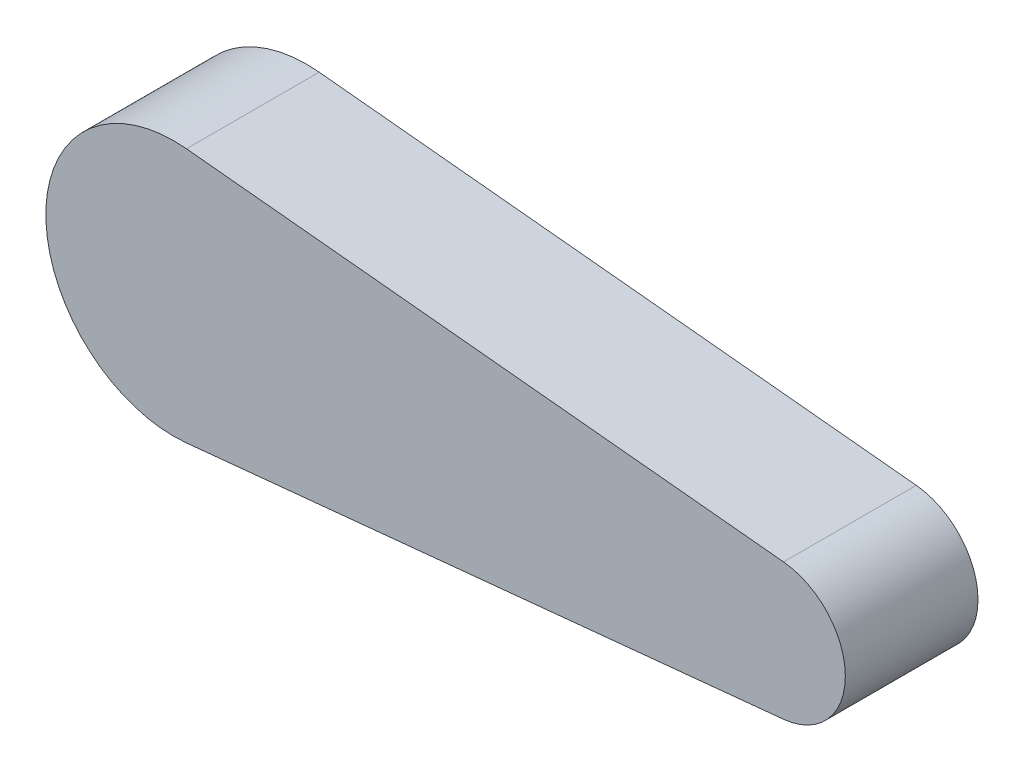
ISO-10303-21;
HEADER;
FILE_DESCRIPTION(('STEP AP214'),'2;1');
FILE_NAME('part.step','',(''),(''),'','','');
FILE_SCHEMA(('AUTOMOTIVE_DESIGN { 1 0 10303 214 1 1 1 1 }'));
ENDSEC;
DATA;
#1=APPLICATION_CONTEXT('core data for automotive mechanical design processes');
#2=APPLICATION_PROTOCOL_DEFINITION('international standard','automotive_design',2000,#1);
#3=PRODUCT_CONTEXT('',#1,'mechanical');
#4=PRODUCT('Part','Part','',(#3));
#5=PRODUCT_RELATED_PRODUCT_CATEGORY('part','',(#4));
#6=PRODUCT_DEFINITION_FORMATION('','',#4);
#7=PRODUCT_DEFINITION_CONTEXT('part definition',#1,'design');
#8=PRODUCT_DEFINITION('design','',#6,#7);
#9=PRODUCT_DEFINITION_SHAPE('','',#8);
#10=(LENGTH_UNIT() NAMED_UNIT(*) SI_UNIT(.MILLI.,.METRE.));
#11=(NAMED_UNIT(*) PLANE_ANGLE_UNIT() SI_UNIT($,.RADIAN.));
#12=(NAMED_UNIT(*) SI_UNIT($,.STERADIAN.) SOLID_ANGLE_UNIT());
#13=UNCERTAINTY_MEASURE_WITH_UNIT(LENGTH_MEASURE(1.E-05),#10,'distance_accuracy_value','');
#14=(GEOMETRIC_REPRESENTATION_CONTEXT(3) GLOBAL_UNCERTAINTY_ASSIGNED_CONTEXT((#13)) GLOBAL_UNIT_ASSIGNED_CONTEXT((#10,
#11,#12)) REPRESENTATION_CONTEXT('',''));
#15=CARTESIAN_POINT('',(0.,0.,0.));
#16=DIRECTION('',(0.,0.,1.));
#17=DIRECTION('',(1.,0.,0.));
#18=AXIS2_PLACEMENT_3D('',#15,#16,#17);
#19=CARTESIAN_POINT('',(9.64712570172139,0.,10.));
#20=DIRECTION('',(0.,0.,-1.));
#21=DIRECTION('',(-1.,0.,0.));
#22=AXIS2_PLACEMENT_3D('',#19,#20,#21);
#23=CYLINDRICAL_SURFACE('',#22,9.64712570172139);
#24=CARTESIAN_POINT('',(9.64712570172139,0.,0.));
#25=DIRECTION('',(0.,0.,1.));
#26=DIRECTION('',(1.,0.,0.));
#27=AXIS2_PLACEMENT_3D('',#24,#25,#26);
#28=CIRCLE('',#27,9.64712570172139);
#29=CARTESIAN_POINT('',(10.5995091879355,9.6,0.));
#30=VERTEX_POINT('',#29);
#31=CARTESIAN_POINT('',(10.5995091879355,-9.6,0.));
#32=VERTEX_POINT('',#31);
#33=EDGE_CURVE('E107',#30,#32,#28,.T.);
#34=ORIENTED_EDGE('',*,*,#33,.T.);
#35=DIRECTION('',(0.,0.,-1.));
#36=VECTOR('',#35,1.);
#37=CARTESIAN_POINT('',(10.5995091879355,-9.6,10.));
#38=LINE('',#37,#36);
#39=CARTESIAN_POINT('',(10.5995091879355,-9.6,10.));
#40=VERTEX_POINT('',#39);
#41=EDGE_CURVE('E11',#40,#32,#38,.T.);
#42=ORIENTED_EDGE('',*,*,#41,.F.);
#43=CARTESIAN_POINT('',(9.64712570172139,0.,10.));
#44=DIRECTION('',(0.,0.,1.));
#45=DIRECTION('',(1.,0.,0.));
#46=AXIS2_PLACEMENT_3D('',#43,#44,#45);
#47=CIRCLE('',#46,9.64712570172139);
#48=CARTESIAN_POINT('',(10.5995091879355,9.6,10.));
#49=VERTEX_POINT('',#48);
#50=EDGE_CURVE('E91',#49,#40,#47,.T.);
#51=ORIENTED_EDGE('',*,*,#50,.F.);
#52=DIRECTION('',(0.,0.,-1.));
#53=VECTOR('',#52,1.);
#54=CARTESIAN_POINT('',(10.5995091879355,9.6,10.));
#55=LINE('',#54,#53);
#56=EDGE_CURVE('E103',#49,#30,#55,.T.);
#57=ORIENTED_EDGE('',*,*,#56,.T.);
#58=EDGE_LOOP('',(#34,#42,#51,#57));
#59=FACE_BOUND('',#58,.T.);
#60=ADVANCED_FACE('F39',(#59),#23,.T.);
#61=CARTESIAN_POINT('',(10.5995091879355,-9.6,10.));
#62=DIRECTION('',(-0.0987219940592439,0.995115052588879,0.));
#63=DIRECTION('',(-0.995115052588879,-0.0987219940592439,0.));
#64=AXIS2_PLACEMENT_3D('',#61,#62,#63);
#65=PLANE('',#64);
#66=DIRECTION('',(0.995115052588878,0.0987219940592439,0.));
#67=VECTOR('',#66,1.);
#68=CARTESIAN_POINT('',(10.5995091879355,-9.6,0.));
#69=LINE('',#68,#67);
#70=CARTESIAN_POINT('',(55.5995091879355,-5.13570240837132,0.));
#71=VERTEX_POINT('',#70);
#72=EDGE_CURVE('E96',#32,#71,#69,.T.);
#73=ORIENTED_EDGE('',*,*,#72,.T.);
#74=DIRECTION('',(0.,0.,-1.));
#75=VECTOR('',#74,1.);
#76=CARTESIAN_POINT('',(55.5995091879355,-5.13570240837132,10.));
#77=LINE('',#76,#75);
#78=CARTESIAN_POINT('',(55.5995091879355,-5.13570240837132,10.));
#79=VERTEX_POINT('',#78);
#80=EDGE_CURVE('E48',#79,#71,#77,.T.);
#81=ORIENTED_EDGE('',*,*,#80,.F.);
#82=DIRECTION('',(0.995115052588878,0.0987219940592439,0.));
#83=VECTOR('',#82,1.);
#84=CARTESIAN_POINT('',(10.5995091879355,-9.6,10.));
#85=LINE('',#84,#83);
#86=EDGE_CURVE('E86',#40,#79,#85,.T.);
#87=ORIENTED_EDGE('',*,*,#86,.F.);
#88=ORIENTED_EDGE('',*,*,#41,.T.);
#89=EDGE_LOOP('',(#73,#81,#87,#88));
#90=FACE_BOUND('',#89,.T.);
#91=ADVANCED_FACE('F95',(#90),#65,.F.);
#92=CARTESIAN_POINT('',(55.0900135458685,0.,10.));
#93=DIRECTION('',(0.,0.,-1.));
#94=DIRECTION('',(-1.,0.,0.));
#95=AXIS2_PLACEMENT_3D('',#92,#93,#94);
#96=CYLINDRICAL_SURFACE('',#95,5.1609131979366);
#97=CARTESIAN_POINT('',(55.0900135458685,0.,0.));
#98=DIRECTION('',(0.,0.,1.));
#99=DIRECTION('',(-1.,0.,0.));
#100=AXIS2_PLACEMENT_3D('',#97,#98,#99);
#101=CIRCLE('',#100,5.1609131979366);
#102=CARTESIAN_POINT('',(55.5995091879355,5.13570240837132,0.));
#103=VERTEX_POINT('',#102);
#104=EDGE_CURVE('E73',#71,#103,#101,.T.);
#105=ORIENTED_EDGE('',*,*,#104,.T.);
#106=DIRECTION('',(0.,0.,-1.));
#107=VECTOR('',#106,1.);
#108=CARTESIAN_POINT('',(55.5995091879355,5.13570240837132,10.));
#109=LINE('',#108,#107);
#110=CARTESIAN_POINT('',(55.5995091879355,5.13570240837132,10.));
#111=VERTEX_POINT('',#110);
#112=EDGE_CURVE('E98',#111,#103,#109,.T.);
#113=ORIENTED_EDGE('',*,*,#112,.F.);
#114=CARTESIAN_POINT('',(55.0900135458685,0.,10.));
#115=DIRECTION('',(0.,0.,1.));
#116=DIRECTION('',(-1.,0.,0.));
#117=AXIS2_PLACEMENT_3D('',#114,#115,#116);
#118=CIRCLE('',#117,5.1609131979366);
#119=EDGE_CURVE('E89',#79,#111,#118,.T.);
#120=ORIENTED_EDGE('',*,*,#119,.F.);
#121=ORIENTED_EDGE('',*,*,#80,.T.);
#122=EDGE_LOOP('',(#105,#113,#120,#121));
#123=FACE_BOUND('',#122,.T.);
#124=ADVANCED_FACE('F99',(#123),#96,.T.);
#125=CARTESIAN_POINT('',(10.5995091879355,9.6,10.));
#126=DIRECTION('',(-0.0987219940592439,-0.995115052588879,0.));
#127=DIRECTION('',(0.995115052588879,-0.0987219940592439,0.));
#128=AXIS2_PLACEMENT_3D('',#125,#126,#127);
#129=PLANE('',#128);
#130=DIRECTION('',(-0.995115052588878,0.0987219940592439,0.));
#131=VECTOR('',#130,1.);
#132=CARTESIAN_POINT('',(10.5995091879355,9.6,0.));
#133=LINE('',#132,#131);
#134=EDGE_CURVE('E79',#103,#30,#133,.T.);
#135=ORIENTED_EDGE('',*,*,#134,.T.);
#136=ORIENTED_EDGE('',*,*,#56,.F.);
#137=DIRECTION('',(-0.995115052588878,0.0987219940592439,0.));
#138=VECTOR('',#137,1.);
#139=CARTESIAN_POINT('',(10.5995091879355,9.6,10.));
#140=LINE('',#139,#138);
#141=EDGE_CURVE('E56',#111,#49,#140,.T.);
#142=ORIENTED_EDGE('',*,*,#141,.F.);
#143=ORIENTED_EDGE('',*,*,#112,.T.);
#144=EDGE_LOOP('',(#135,#136,#142,#143));
#145=FACE_BOUND('',#144,.T.);
#146=ADVANCED_FACE('F121',(#145),#129,.F.);
#147=CARTESIAN_POINT('',(9.64712570172139,0.,10.));
#148=DIRECTION('',(0.,0.,1.));
#149=DIRECTION('',(1.,0.,0.));
#150=AXIS2_PLACEMENT_3D('',#147,#148,#149);
#151=PLANE('',#150);
#152=ORIENTED_EDGE('',*,*,#50,.T.);
#153=ORIENTED_EDGE('',*,*,#86,.T.);
#154=ORIENTED_EDGE('',*,*,#119,.T.);
#155=ORIENTED_EDGE('',*,*,#141,.T.);
#156=EDGE_LOOP('',(#152,#153,#154,#155));
#157=FACE_BOUND('',#156,.T.);
#158=ADVANCED_FACE('F87',(#157),#151,.T.);
#159=CARTESIAN_POINT('',(9.64712570172139,0.,0.));
#160=DIRECTION('',(0.,0.,1.));
#161=DIRECTION('',(1.,0.,0.));
#162=AXIS2_PLACEMENT_3D('',#159,#160,#161);
#163=PLANE('',#162);
#164=CARTESIAN_POINT('',(10.5995091879355,0.,0.));
#165=DIRECTION('',(0.,0.,-1.));
#166=DIRECTION('',(-1.,0.,0.));
#167=AXIS2_PLACEMENT_3D('',#164,#165,#166);
#168=CIRCLE('',#167,3.55);
#169=CARTESIAN_POINT('',(7.04950918793549,0.,0.));
#170=VERTEX_POINT('',#169);
#171=EDGE_CURVE('E128',#170,#170,#168,.T.);
#172=ORIENTED_EDGE('',*,*,#171,.F.);
#173=EDGE_LOOP('',(#172));
#174=FACE_BOUND('',#173,.T.);
#175=ORIENTED_EDGE('',*,*,#33,.F.);
#176=ORIENTED_EDGE('',*,*,#134,.F.);
#177=ORIENTED_EDGE('',*,*,#104,.F.);
#178=ORIENTED_EDGE('',*,*,#72,.F.);
#179=EDGE_LOOP('',(#175,#176,#177,#178));
#180=FACE_BOUND('',#179,.T.);
#181=ADVANCED_FACE('F124',(#174,#180),#163,.F.);
#182=CARTESIAN_POINT('',(10.5995091879355,0.,8.));
#183=DIRECTION('',(0.,0.,-1.));
#184=DIRECTION('',(-1.,0.,0.));
#185=AXIS2_PLACEMENT_3D('',#182,#183,#184);
#186=CYLINDRICAL_SURFACE('',#185,3.55);
#187=CARTESIAN_POINT('',(10.5995091879355,0.,8.));
#188=DIRECTION('',(0.,0.,-1.));
#189=DIRECTION('',(-1.,0.,0.));
#190=AXIS2_PLACEMENT_3D('',#187,#188,#189);
#191=CIRCLE('',#190,3.55);
#192=CARTESIAN_POINT('',(7.04950918793549,0.,8.));
#193=VERTEX_POINT('',#192);
#194=EDGE_CURVE('E111',#193,#193,#191,.T.);
#195=ORIENTED_EDGE('',*,*,#194,.F.);
#196=EDGE_LOOP('',(#195));
#197=FACE_BOUND('',#196,.T.);
#198=ORIENTED_EDGE('',*,*,#171,.T.);
#199=EDGE_LOOP('',(#198));
#200=FACE_BOUND('',#199,.T.);
#201=ADVANCED_FACE('F138',(#197,#200),#186,.F.);
#202=CARTESIAN_POINT('',(10.5995091879355,0.,8.));
#203=DIRECTION('',(0.,0.,-1.));
#204=DIRECTION('',(-1.,0.,0.));
#205=AXIS2_PLACEMENT_3D('',#202,#203,#204);
#206=PLANE('',#205);
#207=ORIENTED_EDGE('',*,*,#194,.T.);
#208=EDGE_LOOP('',(#207));
#209=FACE_BOUND('',#208,.T.);
#210=ADVANCED_FACE('F136',(#209),#206,.T.);
#211=CLOSED_SHELL('',(#60,#91,#124,#146,#158,#181,#201,#210));
#212=MANIFOLD_SOLID_BREP('B2',#211);
#213=ADVANCED_BREP_SHAPE_REPRESENTATION('',(#18,#212),#14);
#214=SHAPE_DEFINITION_REPRESENTATION(#9,#213);
ENDSEC;
END-ISO-10303-21;
